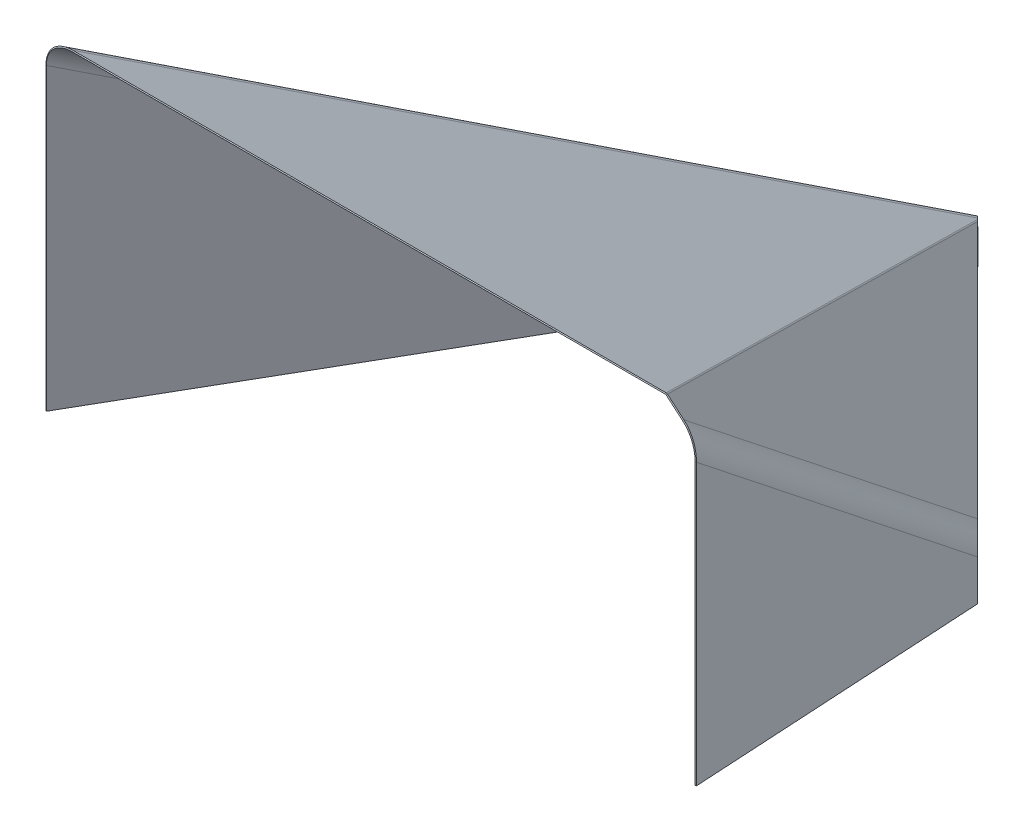
ISO-10303-21;
HEADER;
FILE_DESCRIPTION(('STEP AP214'),'2;1');
FILE_NAME('part.step','',(''),(''),'','','');
FILE_SCHEMA(('AUTOMOTIVE_DESIGN { 1 0 10303 214 1 1 1 1 }'));
ENDSEC;
DATA;
#1=APPLICATION_CONTEXT('core data for automotive mechanical design processes');
#2=APPLICATION_PROTOCOL_DEFINITION('international standard','automotive_design',2000,#1);
#3=PRODUCT_CONTEXT('',#1,'mechanical');
#4=PRODUCT('Part','Part','',(#3));
#5=PRODUCT_RELATED_PRODUCT_CATEGORY('part','',(#4));
#6=PRODUCT_DEFINITION_FORMATION('','',#4);
#7=PRODUCT_DEFINITION_CONTEXT('part definition',#1,'design');
#8=PRODUCT_DEFINITION('design','',#6,#7);
#9=PRODUCT_DEFINITION_SHAPE('','',#8);
#10=(LENGTH_UNIT() NAMED_UNIT(*) SI_UNIT(.MILLI.,.METRE.));
#11=(NAMED_UNIT(*) PLANE_ANGLE_UNIT() SI_UNIT($,.RADIAN.));
#12=(NAMED_UNIT(*) SI_UNIT($,.STERADIAN.) SOLID_ANGLE_UNIT());
#13=UNCERTAINTY_MEASURE_WITH_UNIT(LENGTH_MEASURE(1.E-05),#10,'distance_accuracy_value','');
#14=(GEOMETRIC_REPRESENTATION_CONTEXT(3) GLOBAL_UNCERTAINTY_ASSIGNED_CONTEXT((#13)) GLOBAL_UNIT_ASSIGNED_CONTEXT((#10,
#11,#12)) REPRESENTATION_CONTEXT('',''));
#15=CARTESIAN_POINT('',(0.,0.,0.));
#16=DIRECTION('',(0.,0.,1.));
#17=DIRECTION('',(1.,0.,0.));
#18=AXIS2_PLACEMENT_3D('',#15,#16,#17);
#19=CARTESIAN_POINT('',(499.988952259728,547.800834653383,1.09043068614114));
#20=CARTESIAN_POINT('',(500.379878768752,548.200215994349,0.726953790760765));
#21=CARTESIAN_POINT('',(500.770805277776,548.599597335314,0.363476895380385));
#22=CARTESIAN_POINT('',(501.1617317868,548.99897867628,0.));
#23=CARTESIAN_POINT('',(502.847474747316,545.00282657835,1.09043068614115));
#24=CARTESIAN_POINT('',(504.191242085537,544.469538560971,0.726953790760771));
#25=CARTESIAN_POINT('',(505.535009423757,543.936250543592,0.363476895380393));
#26=CARTESIAN_POINT('',(506.878776761976,543.402962526213,0.));
#27=CARTESIAN_POINT('',(498.517568373189,540.579274391336,-1.09043068614112));
#28=CARTESIAN_POINT('',(499.079482693361,539.247223692026,-0.726953790760743));
#29=CARTESIAN_POINT('',(499.641397013533,537.915172992716,-0.363476895380361));
#30=CARTESIAN_POINT('',(500.203311333706,536.583122293406,0.));
#31=CARTESIAN_POINT('',(495.6590458856,543.377282466369,-1.09043068614113));
#32=CARTESIAN_POINT('',(495.268119376576,542.977901125403,-0.726953790760749));
#33=CARTESIAN_POINT('',(494.877192867553,542.578519784438,-0.363476895380369));
#34=CARTESIAN_POINT('',(494.486266358529,542.179138443472,0.));
#35=CARTESIAN_POINT('',(492.800523398012,546.175290541402,-1.09043068614113));
#36=CARTESIAN_POINT('',(491.456756059792,546.708578558781,-0.726953790760755));
#37=CARTESIAN_POINT('',(490.112988721572,547.24186657616,-0.363476895380377));
#38=CARTESIAN_POINT('',(488.769221383352,547.775154593539,0.));
#39=CARTESIAN_POINT('',(497.13042977214,550.598842728416,1.09043068614114));
#40=CARTESIAN_POINT('',(496.568515451968,551.930893427726,0.72695379076076));
#41=CARTESIAN_POINT('',(496.006601131795,553.262944127036,0.363476895380378));
#42=CARTESIAN_POINT('',(495.444686811623,554.594994826346,0.));
#43=CARTESIAN_POINT('',(499.988952259728,547.800834653383,1.09043068614114));
#44=CARTESIAN_POINT('',(500.379878768752,548.200215994349,0.726953790760765));
#45=CARTESIAN_POINT('',(500.770805277776,548.599597335314,0.363476895380385));
#46=CARTESIAN_POINT('',(501.1617317868,548.99897867628,0.));
#47=(BOUNDED_SURFACE() B_SPLINE_SURFACE(3,3,((#19,#20,#21,#22),(#23,#24,#25,#26),(#27,#28,#29,
#30),(#31,#32,#33,#34),(#35,#36,#37,#38),(#39,#40,#41,#42),(#43,#44,#45,#46)),.UNSPECIFIED.,.T.,
.F.,.F.) B_SPLINE_SURFACE_WITH_KNOTS((4,3,4),(4,4),(0.,0.5,1.),(0.,1.),
.UNSPECIFIED.) GEOMETRIC_REPRESENTATION_ITEM() RATIONAL_B_SPLINE_SURFACE(((1.,1.,1.,1.),
(0.333333333333333,0.333333333333333,0.333333333333333,0.333333333333333),(0.333333333333333,
0.333333333333333,0.333333333333333,0.333333333333333),(1.,1.,1.,1.),(0.333333333333333,
0.333333333333333,0.333333333333333,0.333333333333333),(0.333333333333333,0.333333333333333,
0.333333333333333,0.333333333333333),(1.,1.,1.,1.))) REPRESENTATION_ITEM('') SURFACE());
#48=DIRECTION('',(0.,0.906835888505314,-0.421483892122556));
#49=VECTOR('',#48,1.);
#50=CARTESIAN_POINT('',(498.591008330914,550.,0.));
#51=LINE('',#50,#49);
#52=CARTESIAN_POINT('',(498.591008330914,548.18632822299,0.842967784245071));
#53=VERTEX_POINT('',#52);
#54=CARTESIAN_POINT('',(498.591008330914,550.,0.));
#55=VERTEX_POINT('',#54);
#56=EDGE_CURVE('E11',#53,#55,#51,.T.);
#57=CARTESIAN_POINT('',(497.823999072664,545.589058559876,0.));
#58=DIRECTION('',(0.232444467310787,0.237471700976234,-0.943173770231159));
#59=DIRECTION('',(0.659751956316589,0.674020857977326,0.332299923484706));
#60=AXIS2_PLACEMENT_3D('',#57,#58,#59);
#61=ELLIPSE('',#60,3.2814653542685,2.);
#62=CARTESIAN_POINT('',(499.903155247081,547.877644683672,1.08862525811623));
#63=VERTEX_POINT('',#62);
#64=EDGE_CURVE('E113',#53,#63,#61,.T.);
#65=DIRECTION('',(0.544312629058207,0.638316162802952,-0.544312629058207));
#66=VECTOR('',#65,1.);
#67=CARTESIAN_POINT('',(500.991780505197,549.154277009277,-2.15968500885907E-13));
#68=LINE('',#67,#66);
#69=CARTESIAN_POINT('',(500.991780505197,549.154277009277,-2.15968500885907E-13));
#70=VERTEX_POINT('',#69);
#71=EDGE_CURVE('E50',#63,#70,#68,.T.);
#72=CARTESIAN_POINT('',(497.823999072664,545.589058559876,0.));
#73=DIRECTION('',(0.,0.,-1.));
#74=DIRECTION('',(0.699502018758318,0.714630621897102,0.));
#75=AXIS2_PLACEMENT_3D('',#72,#73,#74);
#76=ELLIPSE('',#75,4.77158410501841,4.);
#77=EDGE_CURVE('E115',#55,#70,#76,.T.);
#78=ORIENTED_EDGE('',*,*,#56,.F.);
#79=ORIENTED_EDGE('',*,*,#64,.T.);
#80=ORIENTED_EDGE('',*,*,#71,.T.);
#81=ORIENTED_EDGE('',*,*,#77,.F.);
#82=EDGE_LOOP('',(#78,#79,#80,#81));
#83=FACE_BOUND('',#82,.T.);
#84=ADVANCED_FACE('F40',(#83),#47,.T.);
#85=CARTESIAN_POINT('',(712.935581503291,368.423012071099,1.11022302462516E-13));
#86=DIRECTION('',(0.353179684231759,0.414174297606952,0.83888244817003));
#87=DIRECTION('',(-0.760912526177416,0.648854473288351,0.));
#88=AXIS2_PLACEMENT_3D('',#85,#86,#87);
#89=PLANE('',#88);
#90=ORIENTED_EDGE('',*,*,#71,.F.);
#91=DIRECTION('',(-0.760912526177416,0.648854473288351,0.));
#92=VECTOR('',#91,1.);
#93=CARTESIAN_POINT('',(711.846956245175,367.146379745493,1.08862525811652));
#94=LINE('',#93,#92);
#95=CARTESIAN_POINT('',(527.604544873605,524.255782830811,1.08862525811592));
#96=VERTEX_POINT('',#95);
#97=EDGE_CURVE('E241',#96,#63,#94,.T.);
#98=ORIENTED_EDGE('',*,*,#97,.F.);
#99=DIRECTION('',(0.544312629058205,0.638316162802954,-0.544312629058207));
#100=VECTOR('',#99,1.);
#101=CARTESIAN_POINT('',(528.693170131722,525.532415156417,-1.73230286297001E-13));
#102=LINE('',#101,#100);
#103=CARTESIAN_POINT('',(528.693170131722,525.532415156417,-1.73230286297001E-13));
#104=VERTEX_POINT('',#103);
#105=EDGE_CURVE('E196',#96,#104,#102,.T.);
#106=ORIENTED_EDGE('',*,*,#105,.T.);
#107=DIRECTION('',(-0.760912526177416,0.648854473288351,0.));
#108=VECTOR('',#107,1.);
#109=CARTESIAN_POINT('',(712.935581503291,368.423012071099,1.11022302462516E-13));
#110=LINE('',#109,#108);
#111=EDGE_CURVE('E214',#104,#70,#110,.T.);
#112=ORIENTED_EDGE('',*,*,#111,.T.);
#113=EDGE_LOOP('',(#90,#98,#106,#112));
#114=FACE_BOUND('',#113,.T.);
#115=ADVANCED_FACE('F215',(#114),#89,.T.);
#116=CARTESIAN_POINT('',(504.373336692309,534.239175202628,1.25499088096534));
#117=CARTESIAN_POINT('',(504.410245894064,534.756941482604,0.836660587310196));
#118=CARTESIAN_POINT('',(504.447155095819,535.274707762581,0.418330293655055));
#119=CARTESIAN_POINT('',(504.484064297575,535.792474042557,0.));
#120=CARTESIAN_POINT('',(600.130344862757,527.413093878416,1.25499088096549));
#121=CARTESIAN_POINT('',(601.497212511324,527.836053473334,0.836660587310347));
#122=CARTESIAN_POINT('',(602.864080159891,528.259013068252,0.418330293655207));
#123=CARTESIAN_POINT('',(604.230947808458,528.68197266317,0.));
#124=CARTESIAN_POINT('',(591.219618492235,402.412459203853,-1.25499088096541));
#125=CARTESIAN_POINT('',(592.512667737292,401.799886238818,-0.836660587310269));
#126=CARTESIAN_POINT('',(593.805716982348,401.187313273783,-0.418330293655125));
#127=CARTESIAN_POINT('',(595.098766227404,400.574740308748,0.));
#128=CARTESIAN_POINT('',(495.462610321787,409.238540528065,-1.25499088096556));
#129=CARTESIAN_POINT('',(495.425701120032,408.720774248089,-0.836660587310418));
#130=CARTESIAN_POINT('',(495.388791918276,408.203007968112,-0.418330293655277));
#131=CARTESIAN_POINT('',(495.351882716521,407.685241688136,-1.35308431126191E-13));
#132=CARTESIAN_POINT('',(399.705602151339,416.064621852277,-1.25499088096571));
#133=CARTESIAN_POINT('',(398.338734502772,415.641662257359,-0.836660587310569));
#134=CARTESIAN_POINT('',(396.971866854205,415.218702662441,-0.418330293655429));
#135=CARTESIAN_POINT('',(395.604999205638,414.795743067523,-2.89199761833328E-13));
#136=CARTESIAN_POINT('',(408.616328521861,541.06525652684,1.25499088096519));
#137=CARTESIAN_POINT('',(407.323279276804,541.677829491875,0.836660587310047));
#138=CARTESIAN_POINT('',(406.030230031748,542.29040245691,0.418330293654903));
#139=CARTESIAN_POINT('',(404.737180786692,542.902975421945,-2.40627504505977E-13));
#140=CARTESIAN_POINT('',(504.373336692309,534.239175202628,1.25499088096534));
#141=CARTESIAN_POINT('',(504.410245894064,534.756941482604,0.836660587310196));
#142=CARTESIAN_POINT('',(504.447155095819,535.274707762581,0.418330293655055));
#143=CARTESIAN_POINT('',(504.484064297575,535.792474042557,0.));
#144=(BOUNDED_SURFACE() B_SPLINE_SURFACE(3,3,((#116,#117,#118,#119),(#120,#121,#122,#123),(#124,
#125,#126,#127),(#128,#129,#130,#131),(#132,#133,#134,#135),(#136,#137,#138,#139),(#140,#141,
#142,#143)),.UNSPECIFIED.,.T.,.F.,.F.) B_SPLINE_SURFACE_WITH_KNOTS((4,3,4),(4,4),(0.,0.5,1.),
(0.,1.),.UNSPECIFIED.) GEOMETRIC_REPRESENTATION_ITEM() RATIONAL_B_SPLINE_SURFACE(((1.,1.,1.,1.),
(0.333333333333333,0.333333333333333,0.333333333333333,0.333333333333333),(0.333333333333333,
0.333333333333333,0.333333333333333,0.333333333333333),(1.,1.,1.,1.),(0.333333333333333,
0.333333333333333,0.333333333333333,0.333333333333333),(0.333333333333333,0.333333333333333,
0.333333333333333,0.333333333333333),(1.,1.,1.,1.))) REPRESENTATION_ITEM('') SURFACE());
#145=CARTESIAN_POINT('',(499.917973507048,471.738857865346,-1.11022302462516E-13));
#146=DIRECTION('',(0.0014238715590786,0.0199742244547531,-0.999799481369747));
#147=DIRECTION('',(0.0710907559139055,0.997268824024297,0.020024910805934));
#148=AXIS2_PLACEMENT_3D('',#145,#146,#147);
#149=ELLIPSE('',#148,62.6714841892609,48.);
#150=CARTESIAN_POINT('',(548.003275685858,474.038326293296,0.114420336097631));
#151=VERTEX_POINT('',#150);
#152=EDGE_CURVE('E265',#96,#151,#149,.T.);
#153=DIRECTION('',(0.998362157071185,0.,-0.0572101680487899));
#154=VECTOR('',#153,1.);
#155=CARTESIAN_POINT('',(550.,474.038326293296,0.));
#156=LINE('',#155,#154);
#157=CARTESIAN_POINT('',(550.,474.038326293296,0.));
#158=VERTEX_POINT('',#157);
#159=EDGE_CURVE('E193',#151,#158,#156,.T.);
#160=CARTESIAN_POINT('',(499.917973507048,471.738857865346,-1.11022302462516E-13));
#161=DIRECTION('',(0.,0.,-1.));
#162=DIRECTION('',(0.0711050137938756,0.997468835108833,0.));
#163=AXIS2_PLACEMENT_3D('',#160,#161,#162);
#164=ELLIPSE('',#163,64.2161578614353,50.);
#165=EDGE_CURVE('E297',#104,#158,#164,.T.);
#166=ORIENTED_EDGE('',*,*,#105,.F.);
#167=ORIENTED_EDGE('',*,*,#152,.T.);
#168=ORIENTED_EDGE('',*,*,#159,.T.);
#169=ORIENTED_EDGE('',*,*,#165,.F.);
#170=EDGE_LOOP('',(#166,#167,#168,#169));
#171=FACE_BOUND('',#170,.T.);
#172=ADVANCED_FACE('F294',(#171),#144,.T.);
#173=CARTESIAN_POINT('',(550.,250.,0.));
#174=DIRECTION('',(0.0572101680487899,0.,0.998362157071185));
#175=DIRECTION('',(0.,-1.,0.));
#176=AXIS2_PLACEMENT_3D('',#173,#174,#175);
#177=PLANE('',#176);
#178=ORIENTED_EDGE('',*,*,#159,.F.);
#179=DIRECTION('',(0.,1.,0.));
#180=VECTOR('',#179,1.);
#181=CARTESIAN_POINT('',(548.003275685858,0.,0.114420336097476));
#182=LINE('',#181,#180);
#183=CARTESIAN_POINT('',(548.003275685858,0.,0.11442033609758));
#184=VERTEX_POINT('',#183);
#185=EDGE_CURVE('E245',#151,#184,#182,.F.);
#186=ORIENTED_EDGE('',*,*,#185,.T.);
#187=DIRECTION('',(0.998362157071185,0.,-0.0572101680487899));
#188=VECTOR('',#187,1.);
#189=CARTESIAN_POINT('',(550.,0.,0.));
#190=LINE('',#189,#188);
#191=CARTESIAN_POINT('',(550.,0.,0.));
#192=VERTEX_POINT('',#191);
#193=EDGE_CURVE('E190',#184,#192,#190,.T.);
#194=ORIENTED_EDGE('',*,*,#193,.T.);
#195=DIRECTION('',(0.,-1.,0.));
#196=VECTOR('',#195,1.);
#197=CARTESIAN_POINT('',(550.,250.,0.));
#198=LINE('',#197,#196);
#199=EDGE_CURVE('E408',#158,#192,#198,.T.);
#200=ORIENTED_EDGE('',*,*,#199,.F.);
#201=EDGE_LOOP('',(#178,#186,#194,#200));
#202=FACE_BOUND('',#201,.T.);
#203=ADVANCED_FACE('F441',(#202),#177,.T.);
#204=CARTESIAN_POINT('',(535.551744037912,0.,-252.133361606718));
#205=DIRECTION('',(0.,-1.,0.));
#206=DIRECTION('',(-0.0572101680487897,0.,-0.998362157071185));
#207=AXIS2_PLACEMENT_3D('',#204,#205,#206);
#208=PLANE('',#207);
#209=ORIENTED_EDGE('',*,*,#193,.F.);
#210=DIRECTION('',(-0.0572101680487899,0.,-0.998362157071185));
#211=VECTOR('',#210,1.);
#212=CARTESIAN_POINT('',(548.003275685858,0.,0.11442033609758));
#213=LINE('',#212,#211);
#214=CARTESIAN_POINT('',(519.106763761682,1.11022302462516E-13,-504.152302877338));
#215=VERTEX_POINT('',#214);
#216=EDGE_CURVE('E272',#184,#215,#213,.T.);
#217=ORIENTED_EDGE('',*,*,#216,.T.);
#218=DIRECTION('',(0.998362157071185,0.,-0.0572101680487899));
#219=VECTOR('',#218,1.);
#220=CARTESIAN_POINT('',(521.103488075824,1.11022302462516E-13,-504.266723213436));
#221=LINE('',#220,#219);
#222=CARTESIAN_POINT('',(521.103488075824,1.11022302462516E-13,-504.266723213436));
#223=VERTEX_POINT('',#222);
#224=EDGE_CURVE('E187',#215,#223,#221,.T.);
#225=ORIENTED_EDGE('',*,*,#224,.T.);
#226=DIRECTION('',(-0.0572101680487897,0.,-0.998362157071185));
#227=VECTOR('',#226,1.);
#228=CARTESIAN_POINT('',(535.551744037912,0.,-252.133361606718));
#229=LINE('',#228,#227);
#230=EDGE_CURVE('E222',#192,#223,#229,.T.);
#231=ORIENTED_EDGE('',*,*,#230,.F.);
#232=EDGE_LOOP('',(#209,#217,#225,#231));
#233=FACE_BOUND('',#232,.T.);
#234=ADVANCED_FACE('F437',(#233),#208,.T.);
#235=CARTESIAN_POINT('',(521.103488075824,26.,-504.266723213436));
#236=DIRECTION('',(-0.0572101680487899,0.,-0.998362157071185));
#237=DIRECTION('',(0.,1.,0.));
#238=AXIS2_PLACEMENT_3D('',#235,#236,#237);
#239=PLANE('',#238);
#240=ORIENTED_EDGE('',*,*,#224,.F.);
#241=DIRECTION('',(0.,1.,0.));
#242=VECTOR('',#241,1.);
#243=CARTESIAN_POINT('',(519.106763761682,1.11022302462516E-13,-504.152302877338));
#244=LINE('',#243,#242);
#245=CARTESIAN_POINT('',(519.106763761682,68.674927148587,-504.152302877338));
#246=VERTEX_POINT('',#245);
#247=EDGE_CURVE('E142',#215,#246,#244,.T.);
#248=ORIENTED_EDGE('',*,*,#247,.T.);
#249=DIRECTION('',(0.998362157071185,0.,-0.0572101680487901));
#250=VECTOR('',#249,1.);
#251=CARTESIAN_POINT('',(521.103488075824,68.674927148587,-504.266723213436));
#252=LINE('',#251,#250);
#253=CARTESIAN_POINT('',(521.103488075824,68.674927148587,-504.266723213436));
#254=VERTEX_POINT('',#253);
#255=EDGE_CURVE('E184',#246,#254,#252,.T.);
#256=ORIENTED_EDGE('',*,*,#255,.T.);
#257=DIRECTION('',(0.,1.,0.));
#258=VECTOR('',#257,1.);
#259=CARTESIAN_POINT('',(521.103488075824,26.,-504.266723213436));
#260=LINE('',#259,#258);
#261=EDGE_CURVE('E210',#223,#254,#260,.T.);
#262=ORIENTED_EDGE('',*,*,#261,.F.);
#263=EDGE_LOOP('',(#240,#248,#256,#262));
#264=FACE_BOUND('',#263,.T.);
#265=ADVANCED_FACE('F395',(#264),#239,.T.);
#266=CARTESIAN_POINT('',(512.659797386666,93.4514353213053,-510.292778013613));
#267=CARTESIAN_POINT('',(513.229361930322,93.7048052638997,-510.529092099618));
#268=CARTESIAN_POINT('',(513.798926473978,93.9581752064941,-510.765406185622));
#269=CARTESIAN_POINT('',(514.368491017634,94.2115451490886,-511.001720271626));
#270=CARTESIAN_POINT('',(462.952489272082,158.830078929167,-560.000086128197));
#271=CARTESIAN_POINT('',(462.831674536369,159.991485588537,-560.92677949357));
#272=CARTESIAN_POINT('',(462.710859800656,161.152892247907,-561.853472858944));
#273=CARTESIAN_POINT('',(462.590045064943,162.314298907278,-562.780166224317));
#274=CARTESIAN_POINT('',(373.587106839239,19.265030783666,-654.200740339002));
#275=CARTESIAN_POINT('',(372.327163016214,19.9196975578474,-654.654805532367));
#276=CARTESIAN_POINT('',(371.067219193189,20.5743643320288,-655.108870725732));
#277=CARTESIAN_POINT('',(369.807275370164,21.2290311062102,-655.562935919097));
#278=CARTESIAN_POINT('',(423.294414953823,-46.1136128241954,-604.493432224419));
#279=CARTESIAN_POINT('',(422.724850410167,-46.3669827667899,-604.257118138415));
#280=CARTESIAN_POINT('',(422.155285866511,-46.6203527093843,-604.02080405241));
#281=CARTESIAN_POINT('',(421.585721322855,-46.8737226519787,-603.784489966406));
#282=CARTESIAN_POINT('',(473.001723068406,-111.492256432057,-554.786124109836));
#283=CARTESIAN_POINT('',(473.12253780412,-112.653663091427,-553.859430744462));
#284=CARTESIAN_POINT('',(473.243352539833,-113.815069750797,-552.932737379089));
#285=CARTESIAN_POINT('',(473.364167275546,-114.976476410168,-552.006044013715));
#286=CARTESIAN_POINT('',(562.367105501249,28.0727917134438,-460.58546989903));
#287=CARTESIAN_POINT('',(563.627049324275,27.4181249392624,-460.131404705666));
#288=CARTESIAN_POINT('',(564.8869931473,26.763458165081,-459.6773395123));
#289=CARTESIAN_POINT('',(566.146936970325,26.1087913908996,-459.223274318935));
#290=CARTESIAN_POINT('',(512.659797386666,93.4514353213053,-510.292778013613));
#291=CARTESIAN_POINT('',(513.229361930322,93.7048052638997,-510.529092099618));
#292=CARTESIAN_POINT('',(513.798926473978,93.9581752064941,-510.765406185622));
#293=CARTESIAN_POINT('',(514.368491017634,94.2115451490886,-511.001720271626));
#294=(BOUNDED_SURFACE() B_SPLINE_SURFACE(3,3,((#266,#267,#268,#269),(#270,#271,#272,#273),(#274,
#275,#276,#277),(#278,#279,#280,#281),(#282,#283,#284,#285),(#286,#287,#288,#289),(#290,#291,
#292,#293)),.UNSPECIFIED.,.T.,.F.,.F.) B_SPLINE_SURFACE_WITH_KNOTS((4,3,4),(4,4),(0.,0.5,1.),
(0.,1.),.UNSPECIFIED.) GEOMETRIC_REPRESENTATION_ITEM() RATIONAL_B_SPLINE_SURFACE(((1.,1.,1.,1.),
(0.333333333333333,0.333333333333333,0.333333333333333,0.333333333333333),(0.333333333333333,
0.333333333333333,0.333333333333333,0.333333333333333),(1.,1.,1.,1.),(0.333333333333333,
0.333333333333333,0.333333333333333,0.333333333333333),(0.333333333333333,0.333333333333333,
0.333333333333333,0.333333333333333),(1.,1.,1.,1.))) REPRESENTATION_ITEM('') SURFACE());
#295=CARTESIAN_POINT('',(467.977106170244,23.6689112485549,-557.393105119016));
#296=DIRECTION('',(-0.715630236318359,-0.0131337085377586,0.698355833774571));
#297=DIRECTION('',(0.468799123654636,0.732140013081646,0.494164327835845));
#298=AXIS2_PLACEMENT_3D('',#295,#296,#297);
#299=ELLIPSE('',#298,95.3130860571725,48.);
#300=CARTESIAN_POINT('',(497.412846484789,100.723367674394,-525.780114288238));
#301=VERTEX_POINT('',#300);
#302=EDGE_CURVE('E260',#246,#301,#299,.T.);
#303=DIRECTION('',(0.544312629058207,0.638316162802952,-0.544312629058207));
#304=VECTOR('',#303,1.);
#305=CARTESIAN_POINT('',(498.501471742906,102.,-526.868739546355));
#306=LINE('',#305,#304);
#307=CARTESIAN_POINT('',(498.501471742906,102.,-526.868739546355));
#308=VERTEX_POINT('',#307);
#309=EDGE_CURVE('E181',#301,#308,#306,.T.);
#310=CARTESIAN_POINT('',(467.977106170244,23.6689112485549,-557.393105119016));
#311=DIRECTION('',(-0.707106781186548,0.,0.707106781186547));
#312=DIRECTION('',(0.481559189998928,0.732257805048978,0.481559189998933));
#313=AXIS2_PLACEMENT_3D('',#310,#311,#312);
#314=ELLIPSE('',#313,96.3357896824538,50.);
#315=EDGE_CURVE('E306',#254,#308,#314,.T.);
#316=ORIENTED_EDGE('',*,*,#255,.F.);
#317=ORIENTED_EDGE('',*,*,#302,.T.);
#318=ORIENTED_EDGE('',*,*,#309,.T.);
#319=ORIENTED_EDGE('',*,*,#315,.F.);
#320=EDGE_LOOP('',(#316,#317,#318,#319));
#321=FACE_BOUND('',#320,.T.);
#322=ADVANCED_FACE('F407',(#321),#294,.T.);
#323=CARTESIAN_POINT('',(273.616114660533,102.,-751.754096628728));
#324=DIRECTION('',(0.451357687258945,-0.769774302185072,-0.451357687258943));
#325=DIRECTION('',(0.707106781186547,0.,0.707106781186548));
#326=AXIS2_PLACEMENT_3D('',#323,#324,#325);
#327=PLANE('',#326);
#328=ORIENTED_EDGE('',*,*,#309,.F.);
#329=DIRECTION('',(0.707106781186547,0.,0.707106781186548));
#330=VECTOR('',#329,1.);
#331=CARTESIAN_POINT('',(272.527489402417,100.723367674394,-750.665471370611));
#332=LINE('',#331,#330);
#333=CARTESIAN_POINT('',(62.2150547371063,100.723367674394,-960.977906035922));
#334=VERTEX_POINT('',#333);
#335=EDGE_CURVE('E240',#334,#301,#332,.T.);
#336=ORIENTED_EDGE('',*,*,#335,.F.);
#337=DIRECTION('',(0.544312629058166,0.638316162802905,-0.544312629058304));
#338=VECTOR('',#337,1.);
#339=CARTESIAN_POINT('',(63.3036799952225,102.,-962.066531294038));
#340=LINE('',#339,#338);
#341=CARTESIAN_POINT('',(63.3036799952225,102.,-962.066531294038));
#342=VERTEX_POINT('',#341);
#343=EDGE_CURVE('E58',#334,#342,#340,.T.);
#344=ORIENTED_EDGE('',*,*,#343,.T.);
#345=DIRECTION('',(0.707106781186547,0.,0.707106781186548));
#346=VECTOR('',#345,1.);
#347=CARTESIAN_POINT('',(273.616114660533,102.,-751.754096628728));
#348=LINE('',#347,#346);
#349=EDGE_CURVE('E225',#342,#308,#348,.T.);
#350=ORIENTED_EDGE('',*,*,#349,.T.);
#351=EDGE_LOOP('',(#328,#336,#344,#350));
#352=FACE_BOUND('',#351,.T.);
#353=ADVANCED_FACE('F506',(#352),#327,.T.);
#354=CARTESIAN_POINT('',(63.7150108732032,100.564624167602,-958.978465806089));
#355=CARTESIAN_POINT('',(64.2999318049777,100.653303054697,-959.285789744304));
#356=CARTESIAN_POINT('',(64.8848527367523,100.741981941793,-959.593113682519));
#357=CARTESIAN_POINT('',(65.4697736685268,100.830660828888,-959.900437620734));
#358=CARTESIAN_POINT('',(62.5505246272066,104.209887335848,-960.142952052086));
#359=CARTESIAN_POINT('',(62.7472834769824,105.513653945692,-960.838438072299));
#360=CARTESIAN_POINT('',(62.9440423267581,106.817420555536,-961.533924092513));
#361=CARTESIAN_POINT('',(63.1408011765338,108.12118716538,-962.229410112727));
#362=CARTESIAN_POINT('',(50.104133458357,94.5476648004132,-977.942812440872));
#363=CARTESIAN_POINT('',(49.1310504445836,95.6740736360663,-978.023650584656));
#364=CARTESIAN_POINT('',(48.1579674308102,96.8004824717195,-978.10448872844));
#365=CARTESIAN_POINT('',(47.1848844170368,97.9268913073726,-978.185326872224));
#366=CARTESIAN_POINT('',(51.2686197043535,90.9024016321673,-976.778326194876));
#367=CARTESIAN_POINT('',(50.683698772579,90.8137227450718,-976.471002256661));
#368=CARTESIAN_POINT('',(50.0987778408044,90.7250438579763,-976.163678318446));
#369=CARTESIAN_POINT('',(49.5138569090299,90.6363649708808,-975.856354380231));
#370=CARTESIAN_POINT('',(52.43310595035,87.2571384639214,-975.61383994888));
#371=CARTESIAN_POINT('',(52.2363471005743,85.9533718540773,-974.918353928666));
#372=CARTESIAN_POINT('',(52.0395882507986,84.6496052442331,-974.222867908452));
#373=CARTESIAN_POINT('',(51.8428294010229,83.345838634389,-973.527381888239));
#374=CARTESIAN_POINT('',(64.8794971191997,96.9193609993561,-957.813979560093));
#375=CARTESIAN_POINT('',(65.8525801329731,95.7929521637029,-957.733141416309));
#376=CARTESIAN_POINT('',(66.8256631467465,94.6665433280498,-957.652303272525));
#377=CARTESIAN_POINT('',(67.7987461605199,93.5401344923966,-957.571465128741));
#378=CARTESIAN_POINT('',(63.7150108732032,100.564624167602,-958.978465806089));
#379=CARTESIAN_POINT('',(64.2999318049777,100.653303054697,-959.285789744304));
#380=CARTESIAN_POINT('',(64.8848527367523,100.741981941793,-959.593113682519));
#381=CARTESIAN_POINT('',(65.4697736685268,100.830660828888,-959.900437620734));
#382=(BOUNDED_SURFACE() B_SPLINE_SURFACE(3,3,((#354,#355,#356,#357),(#358,#359,#360,#361),(#362,
#363,#364,#365),(#366,#367,#368,#369),(#370,#371,#372,#373),(#374,#375,#376,#377),(#378,#379,
#380,#381)),.UNSPECIFIED.,.T.,.F.,.F.) B_SPLINE_SURFACE_WITH_KNOTS((4,3,4),(4,4),(0.,0.5,1.),
(0.,1.),.UNSPECIFIED.) GEOMETRIC_REPRESENTATION_ITEM() RATIONAL_B_SPLINE_SURFACE(((1.,1.,1.,1.),
(0.333333333333333,0.333333333333333,0.333333333333333,0.333333333333333),(0.333333333333333,
0.333333333333333,0.333333333333333,0.333333333333333),(1.,1.,1.,1.),(0.333333333333333,
0.333333333333333,0.333333333333333,0.333333333333333),(0.333333333333333,0.333333333333333,
0.333333333333333,0.333333333333333),(1.,1.,1.,1.))) REPRESENTATION_ITEM('') SURFACE());
#383=CARTESIAN_POINT('',(57.4918152887783,95.7335128998846,-967.878396000483));
#384=DIRECTION('',(-0.800698500993759,-0.0655608590414905,0.595469297502473));
#385=DIRECTION('',(0.523574394844378,0.406454549612996,0.748775368292948));
#386=AXIS2_PLACEMENT_3D('',#383,#384,#385);
#387=ELLIPSE('',#386,11.8859815256523,2.);
#388=CARTESIAN_POINT('',(58.8990317058443,98.9848359149243,-965.628211799171));
#389=VERTEX_POINT('',#388);
#390=EDGE_CURVE('E143',#334,#389,#387,.T.);
#391=DIRECTION('',(0.,0.906835888505313,-0.421483892122557));
#392=VECTOR('',#391,1.);
#393=CARTESIAN_POINT('',(58.8990317058442,100.798507691935,-966.471179583417));
#394=LINE('',#393,#392);
#395=CARTESIAN_POINT('',(58.8990317058442,100.798507691935,-966.471179583417));
#396=VERTEX_POINT('',#395);
#397=EDGE_CURVE('E177',#389,#396,#394,.T.);
#398=CARTESIAN_POINT('',(57.4918152887783,95.7335128998846,-967.878396000483));
#399=DIRECTION('',(-0.707106781186548,0.,0.707106781186547));
#400=DIRECTION('',(0.644397576369052,0.411708060571275,0.64439757636907));
#401=AXIS2_PLACEMENT_3D('',#398,#399,#400);
#402=ELLIPSE('',#401,12.3804909768615,4.);
#403=EDGE_CURVE('E211',#342,#396,#402,.T.);
#404=ORIENTED_EDGE('',*,*,#343,.F.);
#405=ORIENTED_EDGE('',*,*,#390,.T.);
#406=ORIENTED_EDGE('',*,*,#397,.T.);
#407=ORIENTED_EDGE('',*,*,#403,.F.);
#408=EDGE_LOOP('',(#404,#405,#406,#407));
#409=FACE_BOUND('',#408,.T.);
#410=ADVANCED_FACE('F516',(#409),#382,.T.);
#411=CARTESIAN_POINT('',(788.292494987476,439.809788221883,-237.07771630177));
#412=DIRECTION('',(0.740770955731419,-0.283135044825462,-0.609173979694178));
#413=DIRECTION('',(-0.671757687819618,-0.312223025593025,-0.671757687819632));
#414=AXIS2_PLACEMENT_3D('',#411,#412,#413);
#415=PLANE('',#414);
#416=ORIENTED_EDGE('',*,*,#397,.F.);
#417=DIRECTION('',(-0.671757687819618,-0.312223025593025,-0.671757687819632));
#418=VECTOR('',#417,1.);
#419=CARTESIAN_POINT('',(788.292494987476,437.996116444873,-236.234748517525));
#420=LINE('',#419,#418);
#421=CARTESIAN_POINT('',(55.0300140087007,97.1865737835356,-969.497229496315));
#422=VERTEX_POINT('',#421);
#423=EDGE_CURVE('E131',#389,#422,#420,.T.);
#424=ORIENTED_EDGE('',*,*,#423,.T.);
#425=DIRECTION('',(0.,0.906835888505317,-0.42148389212255));
#426=VECTOR('',#425,1.);
#427=CARTESIAN_POINT('',(55.0300140087007,99.0002455605462,-970.340197280561));
#428=LINE('',#427,#426);
#429=CARTESIAN_POINT('',(55.0300140087007,99.0002455605462,-970.340197280561));
#430=VERTEX_POINT('',#429);
#431=EDGE_CURVE('E174',#422,#430,#428,.T.);
#432=ORIENTED_EDGE('',*,*,#431,.T.);
#433=DIRECTION('',(-0.671757687819618,-0.312223025593025,-0.671757687819632));
#434=VECTOR('',#433,1.);
#435=CARTESIAN_POINT('',(788.292494987476,439.809788221883,-237.07771630177));
#436=LINE('',#435,#434);
#437=EDGE_CURVE('E318',#396,#430,#436,.T.);
#438=ORIENTED_EDGE('',*,*,#437,.F.);
#439=EDGE_LOOP('',(#416,#424,#432,#438));
#440=FACE_BOUND('',#439,.T.);
#441=ADVANCED_FACE('F381',(#440),#415,.T.);
#442=CARTESIAN_POINT('',(82.7947678338419,92.85796942557,-941.318763428772));
#443=CARTESIAN_POINT('',(83.232923696262,93.3600579038153,-941.299500908568));
#444=CARTESIAN_POINT('',(83.6710795586822,93.8621463820606,-941.280238388363));
#445=CARTESIAN_POINT('',(84.1092354211023,94.3642348603058,-941.260975868158));
#446=CARTESIAN_POINT('',(25.7284720106271,144.847158321287,-998.385059251988));
#447=CARTESIAN_POINT('',(25.3740404310581,146.071318867528,-999.158384173773));
#448=CARTESIAN_POINT('',(25.0196088514892,147.29547941377,-999.931709095557));
#449=CARTESIAN_POINT('',(24.6651772719202,148.519639960011,-1000.70503401734));
#450=CARTESIAN_POINT('',(-14.3869455112801,54.0224154206655,-1041.01383682719));
#451=CARTESIAN_POINT('',(-15.6176888156893,54.2423990104162,-1041.82568678938));
#452=CARTESIAN_POINT('',(-16.8484321200985,54.462382600167,-1042.63753675158));
#453=CARTESIAN_POINT('',(-18.0791754245077,54.6823661899178,-1043.44938671377));
#454=CARTESIAN_POINT('',(42.6793503119348,2.03322652494854,-983.947541003972));
#455=CARTESIAN_POINT('',(42.2411944495146,1.53113804670326,-983.966803524177));
#456=CARTESIAN_POINT('',(41.8030385870945,1.02904956845797,-983.986066044382));
#457=CARTESIAN_POINT('',(41.3648827246744,0.526961090212684,-984.005328564587));
#458=CARTESIAN_POINT('',(99.7456461351496,-49.9559623707684,-926.881245180756));
#459=CARTESIAN_POINT('',(100.100077714719,-51.1801229170097,-926.107920258972));
#460=CARTESIAN_POINT('',(100.454509294288,-52.4042834632511,-925.334595337188));
#461=CARTESIAN_POINT('',(100.808940873856,-53.6284440094924,-924.561270415403));
#462=CARTESIAN_POINT('',(139.861063657057,40.8687805298531,-884.252467605556));
#463=CARTESIAN_POINT('',(141.091806961466,40.6487969401023,-883.440617643363));
#464=CARTESIAN_POINT('',(142.322550265875,40.4288133503515,-882.628767681168));
#465=CARTESIAN_POINT('',(143.553293570284,40.2088297606007,-881.816917718974));
#466=CARTESIAN_POINT('',(82.7947678338419,92.85796942557,-941.318763428772));
#467=CARTESIAN_POINT('',(83.232923696262,93.3600579038153,-941.299500908568));
#468=CARTESIAN_POINT('',(83.6710795586822,93.8621463820606,-941.280238388363));
#469=CARTESIAN_POINT('',(84.1092354211023,94.3642348603058,-941.260975868158));
#470=(BOUNDED_SURFACE() B_SPLINE_SURFACE(3,3,((#442,#443,#444,#445),(#446,#447,#448,#449),(#450,
#451,#452,#453),(#454,#455,#456,#457),(#458,#459,#460,#461),(#462,#463,#464,#465),(#466,#467,
#468,#469)),.UNSPECIFIED.,.T.,.F.,.F.) B_SPLINE_SURFACE_WITH_KNOTS((4,3,4),(4,4),(0.,0.5,1.),
(0.,1.),.UNSPECIFIED.) GEOMETRIC_REPRESENTATION_ITEM() RATIONAL_B_SPLINE_SURFACE(((1.,1.,1.,1.),
(0.333333333333333,0.333333333333333,0.333333333333333,0.333333333333333),(0.333333333333333,
0.333333333333333,0.333333333333333,0.333333333333333),(1.,1.,1.,1.),(0.333333333333333,
0.333333333333333,0.333333333333333,0.333333333333333),(0.333333333333333,0.333333333333333,
0.333333333333333,0.333333333333333),(1.,1.,1.,1.))) REPRESENTATION_ITEM('') SURFACE());
#471=CARTESIAN_POINT('',(62.7370590728883,47.4455979752593,-962.633152216372));
#472=DIRECTION('',(-0.71330948485418,-0.0138268636064119,0.700712777577143));
#473=DIRECTION('',(0.371254594439894,0.840552215922064,0.394514889979804));
#474=AXIS2_PLACEMENT_3D('',#471,#472,#473);
#475=ELLIPSE('',#474,54.0268297318026,48.);
#476=CARTESIAN_POINT('',(27.861380091692,42.0383809597946,-998.242489249524));
#477=VERTEX_POINT('',#476);
#478=EDGE_CURVE('E136',#422,#477,#475,.T.);
#479=DIRECTION('',(-0.866319423225077,0.,-0.499490397248005));
#480=VECTOR('',#479,1.);
#481=CARTESIAN_POINT('',(26.1287412452417,42.0383809597947,-999.24147004402));
#482=LINE('',#481,#480);
#483=CARTESIAN_POINT('',(26.1287412452417,42.0383809597947,-999.24147004402));
#484=VERTEX_POINT('',#483);
#485=EDGE_CURVE('E171',#477,#484,#482,.T.);
#486=CARTESIAN_POINT('',(62.7370590728883,47.4455979752593,-962.633152216372));
#487=DIRECTION('',(-0.707106781186554,0.,0.70710678118654));
#488=DIRECTION('',(0.382936541839056,0.840665932370691,0.382936541839065));
#489=AXIS2_PLACEMENT_3D('',#486,#487,#488);
#490=ELLIPSE('',#489,55.811274227249,50.);
#491=EDGE_CURVE('E228',#430,#484,#490,.T.);
#492=ORIENTED_EDGE('',*,*,#431,.F.);
#493=ORIENTED_EDGE('',*,*,#478,.T.);
#494=ORIENTED_EDGE('',*,*,#485,.T.);
#495=ORIENTED_EDGE('',*,*,#491,.F.);
#496=EDGE_LOOP('',(#492,#493,#494,#495));
#497=FACE_BOUND('',#496,.T.);
#498=ADVANCED_FACE('F535',(#497),#470,.T.);
#499=CARTESIAN_POINT('',(26.1287412452417,25.9999999999999,-999.24147004402));
#500=DIRECTION('',(0.499490397248005,0.,-0.866319423225077));
#501=DIRECTION('',(0.,1.,0.));
#502=AXIS2_PLACEMENT_3D('',#499,#500,#501);
#503=PLANE('',#502);
#504=ORIENTED_EDGE('',*,*,#485,.F.);
#505=DIRECTION('',(0.,1.,0.));
#506=VECTOR('',#505,1.);
#507=CARTESIAN_POINT('',(27.8613800916918,1.52596752402414E-13,-998.242489249523));
#508=LINE('',#507,#506);
#509=CARTESIAN_POINT('',(27.8613800916918,1.52596752402414E-13,-998.242489249523));
#510=VERTEX_POINT('',#509);
#511=EDGE_CURVE('E234',#510,#477,#508,.T.);
#512=ORIENTED_EDGE('',*,*,#511,.F.);
#513=DIRECTION('',(-0.866319423225077,0.,-0.499490397248005));
#514=VECTOR('',#513,1.);
#515=CARTESIAN_POINT('',(26.1287412452417,1.52655665885959E-13,-999.24147004402));
#516=LINE('',#515,#514);
#517=CARTESIAN_POINT('',(26.1287412452417,1.52655665885959E-13,-999.24147004402));
#518=VERTEX_POINT('',#517);
#519=EDGE_CURVE('E168',#510,#518,#516,.T.);
#520=ORIENTED_EDGE('',*,*,#519,.T.);
#521=DIRECTION('',(0.,1.,0.));
#522=VECTOR('',#521,1.);
#523=CARTESIAN_POINT('',(26.1287412452417,25.9999999999999,-999.24147004402));
#524=LINE('',#523,#522);
#525=EDGE_CURVE('E335',#518,#484,#524,.T.);
#526=ORIENTED_EDGE('',*,*,#525,.T.);
#527=EDGE_LOOP('',(#504,#512,#520,#526));
#528=FACE_BOUND('',#527,.T.);
#529=ADVANCED_FACE('F545',(#528),#503,.T.);
#530=CARTESIAN_POINT('',(-261.935629377379,0.,-499.62073502201));
#531=DIRECTION('',(0.,-1.,0.));
#532=DIRECTION('',(0.499490397248005,0.,-0.866319423225077));
#533=AXIS2_PLACEMENT_3D('',#530,#531,#532);
#534=PLANE('',#533);
#535=ORIENTED_EDGE('',*,*,#519,.F.);
#536=DIRECTION('',(0.499490397248005,0.,-0.866319423225077));
#537=VECTOR('',#536,1.);
#538=CARTESIAN_POINT('',(-548.26736115355,0.,0.99898079449601));
#539=LINE('',#538,#537);
#540=CARTESIAN_POINT('',(-548.26736115355,0.,0.99898079449601));
#541=VERTEX_POINT('',#540);
#542=EDGE_CURVE('E248',#541,#510,#539,.T.);
#543=ORIENTED_EDGE('',*,*,#542,.F.);
#544=DIRECTION('',(-0.866319423225077,0.,-0.499490397248005));
#545=VECTOR('',#544,1.);
#546=CARTESIAN_POINT('',(-550.,0.,0.));
#547=LINE('',#546,#545);
#548=CARTESIAN_POINT('',(-550.,0.,0.));
#549=VERTEX_POINT('',#548);
#550=EDGE_CURVE('E165',#541,#549,#547,.T.);
#551=ORIENTED_EDGE('',*,*,#550,.T.);
#552=DIRECTION('',(0.499490397248005,0.,-0.866319423225077));
#553=VECTOR('',#552,1.);
#554=CARTESIAN_POINT('',(-261.935629377379,0.,-499.62073502201));
#555=LINE('',#554,#553);
#556=EDGE_CURVE('E339',#549,#518,#555,.T.);
#557=ORIENTED_EDGE('',*,*,#556,.T.);
#558=EDGE_LOOP('',(#535,#543,#551,#557));
#559=FACE_BOUND('',#558,.T.);
#560=ADVANCED_FACE('F555',(#559),#534,.T.);
#561=CARTESIAN_POINT('',(-550.,250.,1.11022302462516E-13));
#562=DIRECTION('',(-0.499490397248005,0.,0.866319423225077));
#563=DIRECTION('',(0.,-1.,0.));
#564=AXIS2_PLACEMENT_3D('',#561,#562,#563);
#565=PLANE('',#564);
#566=ORIENTED_EDGE('',*,*,#550,.F.);
#567=DIRECTION('',(0.,1.,0.));
#568=VECTOR('',#567,1.);
#569=CARTESIAN_POINT('',(-548.26736115355,0.,0.998980794496216));
#570=LINE('',#569,#568);
#571=CARTESIAN_POINT('',(-548.26736115355,506.471018995989,0.998980794496282));
#572=VERTEX_POINT('',#571);
#573=EDGE_CURVE('E149',#572,#541,#570,.F.);
#574=ORIENTED_EDGE('',*,*,#573,.F.);
#575=DIRECTION('',(-0.866319423225077,0.,-0.499490397248006));
#576=VECTOR('',#575,1.);
#577=CARTESIAN_POINT('',(-550.,506.471018995989,2.24918314637885E-13));
#578=LINE('',#577,#576);
#579=CARTESIAN_POINT('',(-550.,506.471018995989,2.24918314637885E-13));
#580=VERTEX_POINT('',#579);
#581=EDGE_CURVE('E162',#572,#580,#578,.T.);
#582=ORIENTED_EDGE('',*,*,#581,.T.);
#583=DIRECTION('',(0.,-1.,0.));
#584=VECTOR('',#583,1.);
#585=CARTESIAN_POINT('',(-550.,250.,1.11022302462516E-13));
#586=LINE('',#585,#584);
#587=EDGE_CURVE('E328',#580,#549,#586,.T.);
#588=ORIENTED_EDGE('',*,*,#587,.T.);
#589=EDGE_LOOP('',(#566,#574,#582,#588));
#590=FACE_BOUND('',#589,.T.);
#591=ADVANCED_FACE('F566',(#590),#565,.T.);
#592=CARTESIAN_POINT('',(-539.472611917319,532.902764275241,1.19028476502879));
#593=CARTESIAN_POINT('',(-539.889710508298,533.238998496972,0.793523176685923));
#594=CARTESIAN_POINT('',(-540.306809099278,533.575232718704,0.396761588343055));
#595=CARTESIAN_POINT('',(-540.723907690257,533.911466940435,1.87350135405495E-13));
#596=CARTESIAN_POINT('',(-479.223101663387,607.642288719549,1.19028476502882));
#597=CARTESIAN_POINT('',(-478.803401500839,609.016571891896,0.793523176685957));
#598=CARTESIAN_POINT('',(-478.383701338291,610.390855064242,0.396761588343089));
#599=CARTESIAN_POINT('',(-477.964001175744,611.765138236589,2.21924110775331E-13));
#600=CARTESIAN_POINT('',(-384.847013277973,531.56322416596,-1.19028476502837));
#601=CARTESIAN_POINT('',(-383.593115933467,532.265038894844,-0.7935231766855));
#602=CARTESIAN_POINT('',(-382.339218588961,532.966853623728,-0.396761588342632));
#603=CARTESIAN_POINT('',(-381.085321244455,533.668668352612,2.35801898583145E-13));
#604=CARTESIAN_POINT('',(-445.096523531905,456.823699721652,-1.1902847650284));
#605=CARTESIAN_POINT('',(-444.679424940926,456.487465499921,-0.793523176685534));
#606=CARTESIAN_POINT('',(-444.262326349947,456.15123127819,-0.396761588342666));
#607=CARTESIAN_POINT('',(-443.845227758968,455.814997056458,2.0122792321331E-13));
#608=CARTESIAN_POINT('',(-505.346033785838,382.084175277345,-1.19028476502844));
#609=CARTESIAN_POINT('',(-505.765733948386,380.709892104998,-0.793523176685569));
#610=CARTESIAN_POINT('',(-506.185434110934,379.335608932651,-0.396761588342701));
#611=CARTESIAN_POINT('',(-506.605134273481,377.961325760304,1.66653947843474E-13));
#612=CARTESIAN_POINT('',(-599.722122171252,458.163239830933,1.19028476502876));
#613=CARTESIAN_POINT('',(-600.976019515758,457.46142510205,0.793523176685889));
#614=CARTESIAN_POINT('',(-602.229916860264,456.759610373165,0.396761588343021));
#615=CARTESIAN_POINT('',(-603.48381420477,456.057795644281,1.5277616003566E-13));
#616=CARTESIAN_POINT('',(-539.472611917319,532.902764275241,1.19028476502879));
#617=CARTESIAN_POINT('',(-539.889710508298,533.238998496972,0.793523176685923));
#618=CARTESIAN_POINT('',(-540.306809099278,533.575232718704,0.396761588343055));
#619=CARTESIAN_POINT('',(-540.723907690257,533.911466940435,1.87350135405495E-13));
#620=(BOUNDED_SURFACE() B_SPLINE_SURFACE(3,3,((#592,#593,#594,#595),(#596,#597,#598,#599),(#600,
#601,#602,#603),(#604,#605,#606,#607),(#608,#609,#610,#611),(#612,#613,#614,#615),(#616,#617,
#618,#619)),.UNSPECIFIED.,.T.,.F.,.F.) B_SPLINE_SURFACE_WITH_KNOTS((4,3,4),(4,4),(0.,0.5,1.),
(0.,1.),.UNSPECIFIED.) GEOMETRIC_REPRESENTATION_ITEM() RATIONAL_B_SPLINE_SURFACE(((1.,1.,1.,1.),
(0.333333333333333,0.333333333333333,0.333333333333333,0.333333333333333),(0.333333333333333,
0.333333333333333,0.333333333333333,0.333333333333333),(1.,1.,1.,1.),(0.333333333333333,
0.333333333333333,0.333333333333333,0.333333333333333),(0.333333333333333,0.333333333333333,
0.333333333333333,0.333333333333333),(1.,1.,1.,1.))) REPRESENTATION_ITEM('') SURFACE());
#621=CARTESIAN_POINT('',(-492.284567724612,494.863231998447,1.94289029309402E-13));
#622=DIRECTION('',(-0.0152859827272846,0.012322435550888,-0.99980722957686));
#623=DIRECTION('',(-0.778386634109951,0.62747808260778,0.0196342477789355));
#624=AXIS2_PLACEMENT_3D('',#621,#622,#623);
#625=ELLIPSE('',#624,60.6228860117366,48.);
#626=CARTESIAN_POINT('',(-504.435233579834,548.186328222989,0.842967784245092));
#627=VERTEX_POINT('',#626);
#628=EDGE_CURVE('E246',#572,#627,#625,.T.);
#629=DIRECTION('',(0.,0.906835888505313,-0.421483892122557));
#630=VECTOR('',#629,1.);
#631=CARTESIAN_POINT('',(-504.435233579834,550.,0.));
#632=LINE('',#631,#630);
#633=CARTESIAN_POINT('',(-504.435233579834,550.,0.));
#634=VERTEX_POINT('',#633);
#635=EDGE_CURVE('E44',#627,#634,#632,.T.);
#636=CARTESIAN_POINT('',(-492.284567724612,494.863231998447,1.94289029309402E-13));
#637=DIRECTION('',(0.,0.,-1.));
#638=DIRECTION('',(-0.778536712961539,0.627599065145131,0.));
#639=AXIS2_PLACEMENT_3D('',#636,#637,#638);
#640=ELLIPSE('',#639,62.2184402600387,50.);
#641=EDGE_CURVE('E343',#580,#634,#640,.T.);
#642=ORIENTED_EDGE('',*,*,#581,.F.);
#643=ORIENTED_EDGE('',*,*,#628,.T.);
#644=ORIENTED_EDGE('',*,*,#635,.T.);
#645=ORIENTED_EDGE('',*,*,#641,.F.);
#646=EDGE_LOOP('',(#642,#643,#644,#645));
#647=FACE_BOUND('',#646,.T.);
#648=ADVANCED_FACE('F372',(#647),#620,.T.);
#649=CARTESIAN_POINT('',(0.,550.,0.));
#650=DIRECTION('',(0.,0.421483892122557,0.906835888505313));
#651=DIRECTION('',(1.,0.,0.));
#652=AXIS2_PLACEMENT_3D('',#649,#650,#651);
#653=PLANE('',#652);
#654=DIRECTION('',(1.,0.,0.));
#655=VECTOR('',#654,1.);
#656=CARTESIAN_POINT('',(0.,548.186328222989,0.842967784245119));
#657=LINE('',#656,#655);
#658=EDGE_CURVE('E128',#627,#53,#657,.T.);
#659=ORIENTED_EDGE('',*,*,#658,.T.);
#660=ORIENTED_EDGE('',*,*,#56,.T.);
#661=DIRECTION('',(1.,0.,0.));
#662=VECTOR('',#661,1.);
#663=CARTESIAN_POINT('',(0.,550.,0.));
#664=LINE('',#663,#662);
#665=EDGE_CURVE('E325',#634,#55,#664,.T.);
#666=ORIENTED_EDGE('',*,*,#665,.F.);
#667=ORIENTED_EDGE('',*,*,#635,.F.);
#668=EDGE_LOOP('',(#659,#660,#666,#667));
#669=FACE_BOUND('',#668,.T.);
#670=ADVANCED_FACE('F42',(#669),#653,.T.);
#671=CARTESIAN_POINT('',(-419.032853694585,435.813085126574,-127.0482535768));
#672=DIRECTION('',(-0.463340194226783,0.373510802894221,0.803620273845304));
#673=DIRECTION('',(0.866319423225077,0.,0.499490397248005));
#674=AXIS2_PLACEMENT_3D('',#671,#672,#673);
#675=CYLINDRICAL_SURFACE('',#674,50.);
#676=ORIENTED_EDGE('',*,*,#641,.T.);
#677=DIRECTION('',(0.463340194226783,-0.373510802894221,-0.803620273845304));
#678=VECTOR('',#677,1.);
#679=CARTESIAN_POINT('',(-514.217266071931,557.885555485117,16.9660213553903));
#680=LINE('',#679,#678);
#681=EDGE_CURVE('E322',#430,#634,#680,.F.);
#682=ORIENTED_EDGE('',*,*,#681,.F.);
#683=ORIENTED_EDGE('',*,*,#491,.T.);
#684=DIRECTION('',(0.463340194226783,-0.373510802894221,-0.803620273845304));
#685=VECTOR('',#684,1.);
#686=CARTESIAN_POINT('',(18.5955040120575,48.1111230236574,-986.175773944902));
#687=LINE('',#686,#685);
#688=EDGE_CURVE('E332',#580,#484,#687,.T.);
#689=ORIENTED_EDGE('',*,*,#688,.F.);
#690=EDGE_LOOP('',(#676,#682,#683,#689));
#691=FACE_BOUND('',#690,.T.);
#692=ADVANCED_FACE('F355',(#691),#675,.T.);
#693=CARTESIAN_POINT('',(-550.,0.,0.));
#694=DIRECTION('',(0.866319423225077,0.,0.499490397248005));
#695=DIRECTION('',(0.499490397248005,0.,-0.866319423225077));
#696=AXIS2_PLACEMENT_3D('',#693,#694,#695);
#697=PLANE('',#696);
#698=ORIENTED_EDGE('',*,*,#587,.F.);
#699=ORIENTED_EDGE('',*,*,#688,.T.);
#700=ORIENTED_EDGE('',*,*,#525,.F.);
#701=ORIENTED_EDGE('',*,*,#556,.F.);
#702=EDGE_LOOP('',(#698,#699,#700,#701));
#703=FACE_BOUND('',#702,.T.);
#704=ADVANCED_FACE('F364',(#703),#697,.F.);
#705=CARTESIAN_POINT('',(500.,550.,0.));
#706=DIRECTION('',(0.,0.906835888505313,-0.421483892122557));
#707=DIRECTION('',(-0.381379233135872,-0.389627579686365,-0.838296027475044));
#708=AXIS2_PLACEMENT_3D('',#705,#706,#707);
#709=PLANE('',#708);
#710=ORIENTED_EDGE('',*,*,#665,.T.);
#711=DIRECTION('',(-0.381379233135873,-0.389627579686365,-0.838296027475044));
#712=VECTOR('',#711,1.);
#713=CARTESIAN_POINT('',(60.2800266420803,102.209370339438,-963.435664095353));
#714=LINE('',#713,#712);
#715=EDGE_CURVE('E209',#55,#396,#714,.T.);
#716=ORIENTED_EDGE('',*,*,#715,.T.);
#717=ORIENTED_EDGE('',*,*,#437,.T.);
#718=ORIENTED_EDGE('',*,*,#681,.T.);
#719=EDGE_LOOP('',(#710,#716,#717,#718));
#720=FACE_BOUND('',#719,.T.);
#721=ADVANCED_FACE('F376',(#720),#709,.T.);
#722=CARTESIAN_POINT('',(470.81739408959,63.5127778216834,-507.827860503006));
#723=DIRECTION('',(0.044618071951116,0.625907146054394,0.778620236169988));
#724=DIRECTION('',(0.,-0.779396423087598,0.626531097135855));
#725=AXIS2_PLACEMENT_3D('',#722,#723,#724);
#726=CYLINDRICAL_SURFACE('',#725,50.);
#727=ORIENTED_EDGE('',*,*,#165,.T.);
#728=DIRECTION('',(-0.044618071951116,-0.625907146054394,-0.778620236169988));
#729=VECTOR('',#728,1.);
#730=CARTESIAN_POINT('',(550.930661647333,487.093748684984,16.2407732999933));
#731=LINE('',#730,#729);
#732=EDGE_CURVE('E403',#254,#158,#731,.F.);
#733=ORIENTED_EDGE('',*,*,#732,.F.);
#734=ORIENTED_EDGE('',*,*,#315,.T.);
#735=DIRECTION('',(-0.0446180719511161,-0.625907146054394,-0.778620236169988));
#736=VECTOR('',#735,1.);
#737=CARTESIAN_POINT('',(499.331673322509,113.646157680423,-512.381072963913));
#738=LINE('',#737,#736);
#739=EDGE_CURVE('E221',#104,#308,#738,.T.);
#740=ORIENTED_EDGE('',*,*,#739,.F.);
#741=EDGE_LOOP('',(#727,#733,#734,#740));
#742=FACE_BOUND('',#741,.T.);
#743=ADVANCED_FACE('F309',(#742),#726,.T.);
#744=CARTESIAN_POINT('',(485.748149016497,102.,-539.622062272764));
#745=DIRECTION('',(-0.544312629058207,-0.638316162802952,0.544312629058207));
#746=DIRECTION('',(0.0203163176189851,0.638633557412342,0.76924276180232));
#747=AXIS2_PLACEMENT_3D('',#744,#745,#746);
#748=PLANE('',#747);
#749=ORIENTED_EDGE('',*,*,#349,.F.);
#750=DIRECTION('',(-0.381379233135873,-0.389627579686365,-0.838296027475044));
#751=VECTOR('',#750,1.);
#752=CARTESIAN_POINT('',(500.973196853744,549.135291436629,-0.0408480584041357));
#753=LINE('',#752,#751);
#754=EDGE_CURVE('E207',#342,#70,#753,.F.);
#755=ORIENTED_EDGE('',*,*,#754,.T.);
#756=ORIENTED_EDGE('',*,*,#111,.F.);
#757=ORIENTED_EDGE('',*,*,#739,.T.);
#758=EDGE_LOOP('',(#749,#755,#756,#757));
#759=FACE_BOUND('',#758,.T.);
#760=ADVANCED_FACE('F224',(#759),#748,.F.);
#761=CARTESIAN_POINT('',(550.,0.,0.));
#762=DIRECTION('',(0.998362157071185,0.,-0.0572101680487899));
#763=DIRECTION('',(-0.0572101680487899,0.,-0.998362157071185));
#764=AXIS2_PLACEMENT_3D('',#761,#762,#763);
#765=PLANE('',#764);
#766=ORIENTED_EDGE('',*,*,#261,.T.);
#767=ORIENTED_EDGE('',*,*,#732,.T.);
#768=ORIENTED_EDGE('',*,*,#199,.T.);
#769=ORIENTED_EDGE('',*,*,#230,.T.);
#770=EDGE_LOOP('',(#766,#767,#768,#769));
#771=FACE_BOUND('',#770,.T.);
#772=ADVANCED_FACE('F401',(#771),#765,.T.);
#773=CARTESIAN_POINT('',(498.795946337511,546.582026785417,2.1364024578285));
#774=DIRECTION('',(0.381379233135872,0.389627579686365,0.838296027475044));
#775=DIRECTION('',(0.,-0.906835888505313,0.421483892122557));
#776=AXIS2_PLACEMENT_3D('',#773,#774,#775);
#777=CYLINDRICAL_SURFACE('',#776,4.);
#778=ORIENTED_EDGE('',*,*,#77,.T.);
#779=ORIENTED_EDGE('',*,*,#754,.F.);
#780=ORIENTED_EDGE('',*,*,#403,.T.);
#781=ORIENTED_EDGE('',*,*,#715,.F.);
#782=EDGE_LOOP('',(#778,#779,#780,#781));
#783=FACE_BOUND('',#782,.T.);
#784=ADVANCED_FACE('F204',(#783),#777,.T.);
#785=CARTESIAN_POINT('',(-419.032853694585,435.813085126574,-127.0482535768));
#786=DIRECTION('',(-0.463340194226783,0.373510802894221,0.803620273845304));
#787=DIRECTION('',(0.866319423225077,0.,0.499490397248005));
#788=AXIS2_PLACEMENT_3D('',#785,#786,#787);
#789=CYLINDRICAL_SURFACE('',#788,48.);
#790=ORIENTED_EDGE('',*,*,#628,.F.);
#791=DIRECTION('',(-0.463340194226783,0.373510802894221,0.803620273845304));
#792=VECTOR('',#791,1.);
#793=CARTESIAN_POINT('',(-460.616186009389,435.813085126575,-151.023792644705));
#794=LINE('',#793,#792);
#795=EDGE_CURVE('E157',#572,#477,#794,.F.);
#796=ORIENTED_EDGE('',*,*,#795,.T.);
#797=ORIENTED_EDGE('',*,*,#478,.F.);
#798=DIRECTION('',(-0.463340194226783,0.373510802894221,0.803620273845304));
#799=VECTOR('',#798,1.);
#800=CARTESIAN_POINT('',(-419.032853694585,479.34120777483,-147.279480398683));
#801=LINE('',#800,#799);
#802=EDGE_CURVE('E150',#422,#627,#801,.T.);
#803=ORIENTED_EDGE('',*,*,#802,.T.);
#804=EDGE_LOOP('',(#790,#796,#797,#803));
#805=FACE_BOUND('',#804,.T.);
#806=ADVANCED_FACE('F629',(#805),#789,.F.);
#807=CARTESIAN_POINT('',(-548.26736115355,0.,0.99898079449601));
#808=DIRECTION('',(0.866319423225077,0.,0.499490397248005));
#809=DIRECTION('',(0.499490397248005,0.,-0.866319423225077));
#810=AXIS2_PLACEMENT_3D('',#807,#808,#809);
#811=PLANE('',#810);
#812=ORIENTED_EDGE('',*,*,#573,.T.);
#813=ORIENTED_EDGE('',*,*,#542,.T.);
#814=ORIENTED_EDGE('',*,*,#511,.T.);
#815=ORIENTED_EDGE('',*,*,#795,.F.);
#816=EDGE_LOOP('',(#812,#813,#814,#815));
#817=FACE_BOUND('',#816,.T.);
#818=ADVANCED_FACE('F639',(#817),#811,.T.);
#819=CARTESIAN_POINT('',(500.,548.18632822299,0.842967784245114));
#820=DIRECTION('',(0.,0.906835888505313,-0.421483892122557));
#821=DIRECTION('',(-0.381379233135872,-0.389627579686365,-0.838296027475044));
#822=AXIS2_PLACEMENT_3D('',#819,#820,#821);
#823=PLANE('',#822);
#824=ORIENTED_EDGE('',*,*,#658,.F.);
#825=ORIENTED_EDGE('',*,*,#802,.F.);
#826=ORIENTED_EDGE('',*,*,#423,.F.);
#827=DIRECTION('',(-0.381379233135872,-0.389627579686365,-0.838296027475044));
#828=VECTOR('',#827,1.);
#829=CARTESIAN_POINT('',(498.795946337511,548.395698562427,1.29343467358339));
#830=LINE('',#829,#828);
#831=EDGE_CURVE('E125',#53,#389,#830,.T.);
#832=ORIENTED_EDGE('',*,*,#831,.F.);
#833=EDGE_LOOP('',(#824,#825,#826,#832));
#834=FACE_BOUND('',#833,.T.);
#835=ADVANCED_FACE('F126',(#834),#823,.F.);
#836=CARTESIAN_POINT('',(470.81739408959,63.5127778216834,-507.827860503006));
#837=DIRECTION('',(0.044618071951116,0.625907146054394,0.778620236169988));
#838=DIRECTION('',(0.,-0.779396423087598,0.626531097135855));
#839=AXIS2_PLACEMENT_3D('',#836,#837,#838);
#840=CYLINDRICAL_SURFACE('',#839,48.);
#841=ORIENTED_EDGE('',*,*,#152,.F.);
#842=DIRECTION('',(0.044618071951116,0.625907146054394,0.778620236169988));
#843=VECTOR('',#842,1.);
#844=CARTESIAN_POINT('',(496.944400284384,94.1519536362251,-533.9548666978));
#845=LINE('',#844,#843);
#846=EDGE_CURVE('E237',#96,#301,#845,.F.);
#847=ORIENTED_EDGE('',*,*,#846,.T.);
#848=ORIENTED_EDGE('',*,*,#302,.F.);
#849=DIRECTION('',(0.044618071951116,0.625907146054394,0.778620236169988));
#850=VECTOR('',#849,1.);
#851=CARTESIAN_POINT('',(518.738777629007,63.5127778216834,-510.573948569348));
#852=LINE('',#851,#850);
#853=EDGE_CURVE('E242',#246,#151,#852,.T.);
#854=ORIENTED_EDGE('',*,*,#853,.T.);
#855=EDGE_LOOP('',(#841,#847,#848,#854));
#856=FACE_BOUND('',#855,.T.);
#857=ADVANCED_FACE('F290',(#856),#840,.F.);
#858=CARTESIAN_POINT('',(484.65952375838,100.723367674394,-538.533437014647));
#859=DIRECTION('',(-0.544312629058207,-0.638316162802952,0.544312629058207));
#860=DIRECTION('',(0.0203163176189851,0.638633557412342,0.76924276180232));
#861=AXIS2_PLACEMENT_3D('',#858,#859,#860);
#862=PLANE('',#861);
#863=ORIENTED_EDGE('',*,*,#335,.T.);
#864=ORIENTED_EDGE('',*,*,#846,.F.);
#865=ORIENTED_EDGE('',*,*,#97,.T.);
#866=DIRECTION('',(0.381379233135872,0.389627579686365,0.838296027475044));
#867=VECTOR('',#866,1.);
#868=CARTESIAN_POINT('',(499.884571595627,547.858659111023,1.04777719971209));
#869=LINE('',#868,#867);
#870=EDGE_CURVE('E135',#334,#63,#869,.T.);
#871=ORIENTED_EDGE('',*,*,#870,.F.);
#872=EDGE_LOOP('',(#863,#864,#865,#871));
#873=FACE_BOUND('',#872,.T.);
#874=ADVANCED_FACE('F286',(#873),#862,.T.);
#875=CARTESIAN_POINT('',(548.003275685858,0.,0.11442033609758));
#876=DIRECTION('',(0.998362157071185,0.,-0.0572101680487899));
#877=DIRECTION('',(-0.0572101680487899,0.,-0.998362157071185));
#878=AXIS2_PLACEMENT_3D('',#875,#876,#877);
#879=PLANE('',#878);
#880=ORIENTED_EDGE('',*,*,#247,.F.);
#881=ORIENTED_EDGE('',*,*,#216,.F.);
#882=ORIENTED_EDGE('',*,*,#185,.F.);
#883=ORIENTED_EDGE('',*,*,#853,.F.);
#884=EDGE_LOOP('',(#880,#881,#882,#883));
#885=FACE_BOUND('',#884,.T.);
#886=ADVANCED_FACE('F440',(#885),#879,.F.);
#887=CARTESIAN_POINT('',(498.795946337511,546.582026785417,2.1364024578285));
#888=DIRECTION('',(0.381379233135872,0.389627579686365,0.838296027475044));
#889=DIRECTION('',(0.,-0.906835888505313,0.421483892122557));
#890=AXIS2_PLACEMENT_3D('',#887,#888,#889);
#891=CYLINDRICAL_SURFACE('',#890,2.);
#892=ORIENTED_EDGE('',*,*,#64,.F.);
#893=ORIENTED_EDGE('',*,*,#831,.T.);
#894=ORIENTED_EDGE('',*,*,#390,.F.);
#895=ORIENTED_EDGE('',*,*,#870,.T.);
#896=EDGE_LOOP('',(#892,#893,#894,#895));
#897=FACE_BOUND('',#896,.T.);
#898=ADVANCED_FACE('F139',(#897),#891,.F.);
#899=CLOSED_SHELL('',(#84,#115,#172,#203,#234,#265,#322,#353,#410,#441,#498,#529,#560,#591,#648,
#670,#692,#704,#721,#743,#760,#772,#784,#806,#818,#835,#857,#874,#886,#898));
#900=MANIFOLD_SOLID_BREP('B2',#899);
#901=ADVANCED_BREP_SHAPE_REPRESENTATION('',(#18,#900),#14);
#902=SHAPE_DEFINITION_REPRESENTATION(#9,#901);
ENDSEC;
END-ISO-10303-21;
